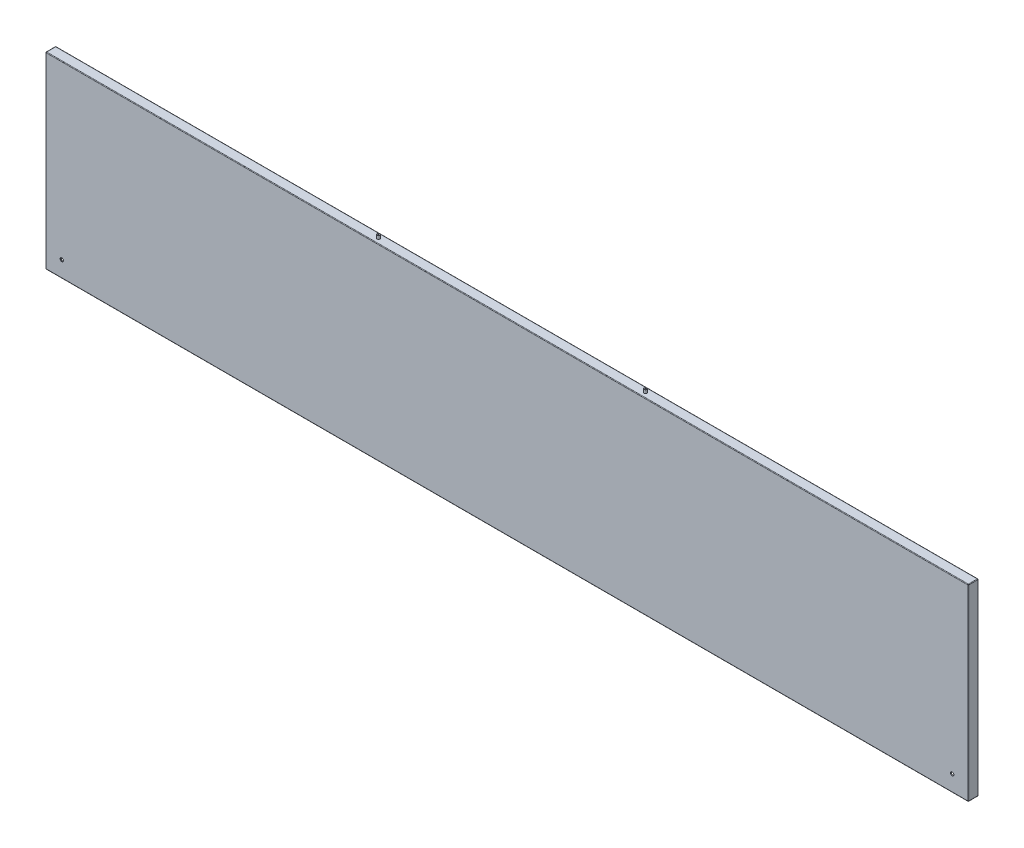
ISO-10303-21;
HEADER;
FILE_DESCRIPTION(('STEP AP214'),'2;1');
FILE_NAME('part.step','',(''),(''),'','','');
FILE_SCHEMA(('AUTOMOTIVE_DESIGN { 1 0 10303 214 1 1 1 1 }'));
ENDSEC;
DATA;
#1=APPLICATION_CONTEXT('core data for automotive mechanical design processes');
#2=APPLICATION_PROTOCOL_DEFINITION('international standard','automotive_design',2000,#1);
#3=PRODUCT_CONTEXT('',#1,'mechanical');
#4=PRODUCT('Part','Part','',(#3));
#5=PRODUCT_RELATED_PRODUCT_CATEGORY('part','',(#4));
#6=PRODUCT_DEFINITION_FORMATION('','',#4);
#7=PRODUCT_DEFINITION_CONTEXT('part definition',#1,'design');
#8=PRODUCT_DEFINITION('design','',#6,#7);
#9=PRODUCT_DEFINITION_SHAPE('','',#8);
#10=(LENGTH_UNIT() NAMED_UNIT(*) SI_UNIT(.MILLI.,.METRE.));
#11=(NAMED_UNIT(*) PLANE_ANGLE_UNIT() SI_UNIT($,.RADIAN.));
#12=(NAMED_UNIT(*) SI_UNIT($,.STERADIAN.) SOLID_ANGLE_UNIT());
#13=UNCERTAINTY_MEASURE_WITH_UNIT(LENGTH_MEASURE(1.E-05),#10,'distance_accuracy_value','');
#14=(GEOMETRIC_REPRESENTATION_CONTEXT(3) GLOBAL_UNCERTAINTY_ASSIGNED_CONTEXT((#13)) GLOBAL_UNIT_ASSIGNED_CONTEXT((#10,
#11,#12)) REPRESENTATION_CONTEXT('',''));
#15=CARTESIAN_POINT('',(0.,0.,0.));
#16=DIRECTION('',(0.,0.,1.));
#17=DIRECTION('',(1.,0.,0.));
#18=AXIS2_PLACEMENT_3D('',#15,#16,#17);
#19=CARTESIAN_POINT('',(829.,169.,1.5));
#20=DIRECTION('',(0.,-1.,0.));
#21=DIRECTION('',(1.,0.,0.));
#22=AXIS2_PLACEMENT_3D('',#19,#20,#21);
#23=PLANE('',#22);
#24=DIRECTION('',(0.,0.,-1.));
#25=VECTOR('',#24,1.);
#26=CARTESIAN_POINT('',(828.,169.,1.5));
#27=LINE('',#26,#25);
#28=CARTESIAN_POINT('',(828.,169.,0.5));
#29=VERTEX_POINT('',#28);
#30=CARTESIAN_POINT('',(828.,169.,-15.5));
#31=VERTEX_POINT('',#30);
#32=EDGE_CURVE('E293',#29,#31,#27,.T.);
#33=ORIENTED_EDGE('',*,*,#32,.T.);
#34=DIRECTION('',(1.,0.,0.));
#35=VECTOR('',#34,1.);
#36=CARTESIAN_POINT('',(829.,169.,-15.5));
#37=LINE('',#36,#35);
#38=CARTESIAN_POINT('',(-828.,169.,-15.5));
#39=VERTEX_POINT('',#38);
#40=EDGE_CURVE('E299',#31,#39,#37,.F.);
#41=ORIENTED_EDGE('',*,*,#40,.T.);
#42=DIRECTION('',(0.,0.,-1.));
#43=VECTOR('',#42,1.);
#44=CARTESIAN_POINT('',(-828.,169.,1.5));
#45=LINE('',#44,#43);
#46=CARTESIAN_POINT('',(-828.,169.,0.5));
#47=VERTEX_POINT('',#46);
#48=EDGE_CURVE('E297',#39,#47,#45,.F.);
#49=ORIENTED_EDGE('',*,*,#48,.T.);
#50=DIRECTION('',(-1.,0.,0.));
#51=VECTOR('',#50,1.);
#52=CARTESIAN_POINT('',(829.,169.,0.5));
#53=LINE('',#52,#51);
#54=EDGE_CURVE('E295',#47,#29,#53,.F.);
#55=ORIENTED_EDGE('',*,*,#54,.T.);
#56=EDGE_LOOP('',(#33,#41,#49,#55));
#57=FACE_BOUND('',#56,.T.);
#58=CARTESIAN_POINT('',(240.,169.,-7.5));
#59=DIRECTION('',(0.,-1.,0.));
#60=DIRECTION('',(1.,0.,0.));
#61=AXIS2_PLACEMENT_3D('',#58,#59,#60);
#62=CIRCLE('',#61,2.50000000000002);
#63=CARTESIAN_POINT('',(242.5,169.,-7.5));
#64=VERTEX_POINT('',#63);
#65=EDGE_CURVE('E251',#64,#64,#62,.F.);
#66=ORIENTED_EDGE('',*,*,#65,.F.);
#67=EDGE_LOOP('',(#66));
#68=FACE_BOUND('',#67,.T.);
#69=CARTESIAN_POINT('',(-240.,169.,-7.5));
#70=DIRECTION('',(0.,-1.,0.));
#71=DIRECTION('',(1.,0.,0.));
#72=AXIS2_PLACEMENT_3D('',#69,#70,#71);
#73=CIRCLE('',#72,2.5);
#74=CARTESIAN_POINT('',(-237.5,169.,-7.5));
#75=VERTEX_POINT('',#74);
#76=EDGE_CURVE('E254',#75,#75,#73,.F.);
#77=ORIENTED_EDGE('',*,*,#76,.F.);
#78=EDGE_LOOP('',(#77));
#79=FACE_BOUND('',#78,.T.);
#80=ADVANCED_FACE('F33',(#57,#68,#79),#23,.F.);
#81=CARTESIAN_POINT('',(-829.,-169.,1.5));
#82=DIRECTION('',(1.,0.,0.));
#83=DIRECTION('',(0.,0.,-1.));
#84=AXIS2_PLACEMENT_3D('',#81,#82,#83);
#85=PLANE('',#84);
#86=DIRECTION('',(0.,-1.,0.));
#87=VECTOR('',#86,1.);
#88=CARTESIAN_POINT('',(-829.,169.,0.5));
#89=LINE('',#88,#87);
#90=CARTESIAN_POINT('',(-829.,-168.,0.5));
#91=VERTEX_POINT('',#90);
#92=CARTESIAN_POINT('',(-829.,168.,0.5));
#93=VERTEX_POINT('',#92);
#94=EDGE_CURVE('E302',#91,#93,#89,.F.);
#95=ORIENTED_EDGE('',*,*,#94,.T.);
#96=DIRECTION('',(0.,0.,-1.));
#97=VECTOR('',#96,1.);
#98=CARTESIAN_POINT('',(-829.,168.,1.5));
#99=LINE('',#98,#97);
#100=CARTESIAN_POINT('',(-829.,168.,-15.5));
#101=VERTEX_POINT('',#100);
#102=EDGE_CURVE('E308',#93,#101,#99,.T.);
#103=ORIENTED_EDGE('',*,*,#102,.T.);
#104=DIRECTION('',(0.,1.,0.));
#105=VECTOR('',#104,1.);
#106=CARTESIAN_POINT('',(-829.,-169.,-15.5));
#107=LINE('',#106,#105);
#108=CARTESIAN_POINT('',(-829.,-168.,-15.5));
#109=VERTEX_POINT('',#108);
#110=EDGE_CURVE('E306',#101,#109,#107,.F.);
#111=ORIENTED_EDGE('',*,*,#110,.T.);
#112=DIRECTION('',(0.,0.,-1.));
#113=VECTOR('',#112,1.);
#114=CARTESIAN_POINT('',(-829.,-168.,1.5));
#115=LINE('',#114,#113);
#116=EDGE_CURVE('E304',#109,#91,#115,.F.);
#117=ORIENTED_EDGE('',*,*,#116,.T.);
#118=EDGE_LOOP('',(#95,#103,#111,#117));
#119=FACE_BOUND('',#118,.T.);
#120=ADVANCED_FACE('F418',(#119),#85,.F.);
#121=CARTESIAN_POINT('',(829.,-169.,1.5));
#122=DIRECTION('',(0.,1.,0.));
#123=DIRECTION('',(-1.,0.,0.));
#124=AXIS2_PLACEMENT_3D('',#121,#122,#123);
#125=PLANE('',#124);
#126=DIRECTION('',(0.,0.,-1.));
#127=VECTOR('',#126,1.);
#128=CARTESIAN_POINT('',(-828.,-169.,1.5));
#129=LINE('',#128,#127);
#130=CARTESIAN_POINT('',(-828.,-169.,0.5));
#131=VERTEX_POINT('',#130);
#132=CARTESIAN_POINT('',(-828.,-169.,-15.5));
#133=VERTEX_POINT('',#132);
#134=EDGE_CURVE('E277',#131,#133,#129,.T.);
#135=ORIENTED_EDGE('',*,*,#134,.T.);
#136=DIRECTION('',(-1.,0.,0.));
#137=VECTOR('',#136,1.);
#138=CARTESIAN_POINT('',(829.,-169.,-15.5));
#139=LINE('',#138,#137);
#140=CARTESIAN_POINT('',(828.,-169.,-15.5));
#141=VERTEX_POINT('',#140);
#142=EDGE_CURVE('E281',#133,#141,#139,.F.);
#143=ORIENTED_EDGE('',*,*,#142,.T.);
#144=DIRECTION('',(0.,0.,-1.));
#145=VECTOR('',#144,1.);
#146=CARTESIAN_POINT('',(828.,-169.,1.5));
#147=LINE('',#146,#145);
#148=CARTESIAN_POINT('',(828.,-169.,0.5));
#149=VERTEX_POINT('',#148);
#150=EDGE_CURVE('E279',#141,#149,#147,.F.);
#151=ORIENTED_EDGE('',*,*,#150,.T.);
#152=DIRECTION('',(1.,0.,0.));
#153=VECTOR('',#152,1.);
#154=CARTESIAN_POINT('',(-829.,-169.,0.5));
#155=LINE('',#154,#153);
#156=EDGE_CURVE('E275',#149,#131,#155,.F.);
#157=ORIENTED_EDGE('',*,*,#156,.T.);
#158=EDGE_LOOP('',(#135,#143,#151,#157));
#159=FACE_BOUND('',#158,.T.);
#160=ADVANCED_FACE('F493',(#159),#125,.F.);
#161=CARTESIAN_POINT('',(829.,-169.,1.5));
#162=DIRECTION('',(-1.,0.,0.));
#163=DIRECTION('',(0.,0.,1.));
#164=AXIS2_PLACEMENT_3D('',#161,#162,#163);
#165=PLANE('',#164);
#166=DIRECTION('',(0.,0.,-1.));
#167=VECTOR('',#166,1.);
#168=CARTESIAN_POINT('',(829.,-168.,1.5));
#169=LINE('',#168,#167);
#170=CARTESIAN_POINT('',(829.,-168.,0.5));
#171=VERTEX_POINT('',#170);
#172=CARTESIAN_POINT('',(829.,-168.,-15.5));
#173=VERTEX_POINT('',#172);
#174=EDGE_CURVE('E288',#171,#173,#169,.T.);
#175=ORIENTED_EDGE('',*,*,#174,.T.);
#176=DIRECTION('',(0.,-1.,0.));
#177=VECTOR('',#176,1.);
#178=CARTESIAN_POINT('',(829.,-169.,-15.5));
#179=LINE('',#178,#177);
#180=CARTESIAN_POINT('',(829.,168.,-15.5));
#181=VERTEX_POINT('',#180);
#182=EDGE_CURVE('E290',#173,#181,#179,.F.);
#183=ORIENTED_EDGE('',*,*,#182,.T.);
#184=DIRECTION('',(0.,0.,-1.));
#185=VECTOR('',#184,1.);
#186=CARTESIAN_POINT('',(829.,168.,1.5));
#187=LINE('',#186,#185);
#188=CARTESIAN_POINT('',(829.,168.,0.5));
#189=VERTEX_POINT('',#188);
#190=EDGE_CURVE('E284',#181,#189,#187,.F.);
#191=ORIENTED_EDGE('',*,*,#190,.T.);
#192=DIRECTION('',(0.,1.,0.));
#193=VECTOR('',#192,1.);
#194=CARTESIAN_POINT('',(829.,-169.,0.5));
#195=LINE('',#194,#193);
#196=EDGE_CURVE('E286',#189,#171,#195,.F.);
#197=ORIENTED_EDGE('',*,*,#196,.T.);
#198=EDGE_LOOP('',(#175,#183,#191,#197));
#199=FACE_BOUND('',#198,.T.);
#200=ADVANCED_FACE('F485',(#199),#165,.F.);
#201=CARTESIAN_POINT('',(0.,0.,1.5));
#202=DIRECTION('',(0.,0.,1.));
#203=DIRECTION('',(1.,0.,0.));
#204=AXIS2_PLACEMENT_3D('',#201,#202,#203);
#205=PLANE('',#204);
#206=DIRECTION('',(-1.,0.,0.));
#207=VECTOR('',#206,1.);
#208=CARTESIAN_POINT('',(-829.,168.,1.5));
#209=LINE('',#208,#207);
#210=CARTESIAN_POINT('',(828.,168.,1.5));
#211=VERTEX_POINT('',#210);
#212=CARTESIAN_POINT('',(-828.,168.,1.5));
#213=VERTEX_POINT('',#212);
#214=EDGE_CURVE('E57',#211,#213,#209,.T.);
#215=ORIENTED_EDGE('',*,*,#214,.T.);
#216=DIRECTION('',(0.,-1.,0.));
#217=VECTOR('',#216,1.);
#218=CARTESIAN_POINT('',(-828.,-169.,1.5));
#219=LINE('',#218,#217);
#220=CARTESIAN_POINT('',(-828.,-168.,1.5));
#221=VERTEX_POINT('',#220);
#222=EDGE_CURVE('E11',#213,#221,#219,.T.);
#223=ORIENTED_EDGE('',*,*,#222,.T.);
#224=DIRECTION('',(1.,0.,0.));
#225=VECTOR('',#224,1.);
#226=CARTESIAN_POINT('',(829.,-168.,1.5));
#227=LINE('',#226,#225);
#228=CARTESIAN_POINT('',(828.,-168.,1.5));
#229=VERTEX_POINT('',#228);
#230=EDGE_CURVE('E42',#221,#229,#227,.T.);
#231=ORIENTED_EDGE('',*,*,#230,.T.);
#232=DIRECTION('',(0.,1.,0.));
#233=VECTOR('',#232,1.);
#234=CARTESIAN_POINT('',(828.,169.,1.5));
#235=LINE('',#234,#233);
#236=EDGE_CURVE('E311',#229,#211,#235,.T.);
#237=ORIENTED_EDGE('',*,*,#236,.T.);
#238=EDGE_LOOP('',(#215,#223,#231,#237));
#239=FACE_BOUND('',#238,.T.);
#240=CARTESIAN_POINT('',(800.,-140.,1.5));
#241=DIRECTION('',(0.,0.,1.));
#242=DIRECTION('',(1.,0.,0.));
#243=AXIS2_PLACEMENT_3D('',#240,#241,#242);
#244=CIRCLE('',#243,3.00000000000005);
#245=CARTESIAN_POINT('',(803.,-140.,1.5));
#246=VERTEX_POINT('',#245);
#247=EDGE_CURVE('E266',#246,#246,#244,.T.);
#248=ORIENTED_EDGE('',*,*,#247,.F.);
#249=EDGE_LOOP('',(#248));
#250=FACE_BOUND('',#249,.T.);
#251=CARTESIAN_POINT('',(-800.,-140.,1.5));
#252=DIRECTION('',(0.,0.,1.));
#253=DIRECTION('',(1.,0.,0.));
#254=AXIS2_PLACEMENT_3D('',#251,#252,#253);
#255=CIRCLE('',#254,3.00000000000005);
#256=CARTESIAN_POINT('',(-797.,-140.,1.5));
#257=VERTEX_POINT('',#256);
#258=EDGE_CURVE('E262',#257,#257,#255,.T.);
#259=ORIENTED_EDGE('',*,*,#258,.F.);
#260=EDGE_LOOP('',(#259));
#261=FACE_BOUND('',#260,.T.);
#262=ADVANCED_FACE('F463',(#239,#250,#261),#205,.T.);
#263=CARTESIAN_POINT('',(0.,0.,-16.5));
#264=DIRECTION('',(0.,0.,1.));
#265=DIRECTION('',(1.,0.,0.));
#266=AXIS2_PLACEMENT_3D('',#263,#264,#265);
#267=PLANE('',#266);
#268=DIRECTION('',(0.,-1.,0.));
#269=VECTOR('',#268,1.);
#270=CARTESIAN_POINT('',(828.,0.,-16.5));
#271=LINE('',#270,#269);
#272=CARTESIAN_POINT('',(828.,168.,-16.5));
#273=VERTEX_POINT('',#272);
#274=CARTESIAN_POINT('',(828.,-168.,-16.5));
#275=VERTEX_POINT('',#274);
#276=EDGE_CURVE('E270',#273,#275,#271,.T.);
#277=ORIENTED_EDGE('',*,*,#276,.T.);
#278=DIRECTION('',(-1.,0.,0.));
#279=VECTOR('',#278,1.);
#280=CARTESIAN_POINT('',(0.,-168.,-16.5));
#281=LINE('',#280,#279);
#282=CARTESIAN_POINT('',(-828.,-168.,-16.5));
#283=VERTEX_POINT('',#282);
#284=EDGE_CURVE('E272',#275,#283,#281,.T.);
#285=ORIENTED_EDGE('',*,*,#284,.T.);
#286=DIRECTION('',(0.,1.,0.));
#287=VECTOR('',#286,1.);
#288=CARTESIAN_POINT('',(-828.,0.,-16.5));
#289=LINE('',#288,#287);
#290=CARTESIAN_POINT('',(-828.,168.,-16.5));
#291=VERTEX_POINT('',#290);
#292=EDGE_CURVE('E257',#283,#291,#289,.T.);
#293=ORIENTED_EDGE('',*,*,#292,.T.);
#294=DIRECTION('',(1.,0.,0.));
#295=VECTOR('',#294,1.);
#296=CARTESIAN_POINT('',(0.,168.,-16.5));
#297=LINE('',#296,#295);
#298=EDGE_CURVE('E268',#291,#273,#297,.T.);
#299=ORIENTED_EDGE('',*,*,#298,.T.);
#300=EDGE_LOOP('',(#277,#285,#293,#299));
#301=FACE_BOUND('',#300,.T.);
#302=DIRECTION('',(0.,1.,0.));
#303=VECTOR('',#302,1.);
#304=CARTESIAN_POINT('',(-819.,-159.,-16.5));
#305=LINE('',#304,#303);
#306=CARTESIAN_POINT('',(-819.,-159.,-16.5));
#307=VERTEX_POINT('',#306);
#308=CARTESIAN_POINT('',(-819.,159.,-16.5));
#309=VERTEX_POINT('',#308);
#310=EDGE_CURVE('E175',#307,#309,#305,.T.);
#311=ORIENTED_EDGE('',*,*,#310,.F.);
#312=DIRECTION('',(-1.,0.,0.));
#313=VECTOR('',#312,1.);
#314=CARTESIAN_POINT('',(819.,-159.,-16.5));
#315=LINE('',#314,#313);
#316=CARTESIAN_POINT('',(819.,-159.,-16.5));
#317=VERTEX_POINT('',#316);
#318=EDGE_CURVE('E201',#317,#307,#315,.T.);
#319=ORIENTED_EDGE('',*,*,#318,.F.);
#320=DIRECTION('',(0.,-1.,0.));
#321=VECTOR('',#320,1.);
#322=CARTESIAN_POINT('',(819.,-159.,-16.5));
#323=LINE('',#322,#321);
#324=CARTESIAN_POINT('',(819.,159.,-16.5));
#325=VERTEX_POINT('',#324);
#326=EDGE_CURVE('E199',#325,#317,#323,.T.);
#327=ORIENTED_EDGE('',*,*,#326,.F.);
#328=DIRECTION('',(1.,0.,0.));
#329=VECTOR('',#328,1.);
#330=CARTESIAN_POINT('',(819.,159.,-16.5));
#331=LINE('',#330,#329);
#332=EDGE_CURVE('E185',#309,#325,#331,.T.);
#333=ORIENTED_EDGE('',*,*,#332,.F.);
#334=EDGE_LOOP('',(#311,#319,#327,#333));
#335=FACE_BOUND('',#334,.T.);
#336=ADVANCED_FACE('F197',(#301,#335),#267,.F.);
#337=CARTESIAN_POINT('',(0.,0.,-15.));
#338=DIRECTION('',(0.,0.,1.));
#339=DIRECTION('',(1.,0.,0.));
#340=AXIS2_PLACEMENT_3D('',#337,#338,#339);
#341=PLANE('',#340);
#342=DIRECTION('',(1.,0.,0.));
#343=VECTOR('',#342,1.);
#344=CARTESIAN_POINT('',(827.500000000001,167.5,-15.));
#345=LINE('',#344,#343);
#346=CARTESIAN_POINT('',(-827.5,167.5,-15.));
#347=VERTEX_POINT('',#346);
#348=CARTESIAN_POINT('',(827.500000000001,167.5,-15.));
#349=VERTEX_POINT('',#348);
#350=EDGE_CURVE('E222',#347,#349,#345,.T.);
#351=ORIENTED_EDGE('',*,*,#350,.F.);
#352=DIRECTION('',(0.,1.,0.));
#353=VECTOR('',#352,1.);
#354=CARTESIAN_POINT('',(-827.5,-167.5,-15.));
#355=LINE('',#354,#353);
#356=CARTESIAN_POINT('',(-827.5,-167.5,-15.));
#357=VERTEX_POINT('',#356);
#358=EDGE_CURVE('E219',#357,#347,#355,.T.);
#359=ORIENTED_EDGE('',*,*,#358,.F.);
#360=DIRECTION('',(-1.,0.,0.));
#361=VECTOR('',#360,1.);
#362=CARTESIAN_POINT('',(827.500000000001,-167.5,-15.));
#363=LINE('',#362,#361);
#364=CARTESIAN_POINT('',(827.500000000001,-167.5,-15.));
#365=VERTEX_POINT('',#364);
#366=EDGE_CURVE('E229',#365,#357,#363,.T.);
#367=ORIENTED_EDGE('',*,*,#366,.F.);
#368=DIRECTION('',(0.,-1.,0.));
#369=VECTOR('',#368,1.);
#370=CARTESIAN_POINT('',(827.500000000001,-167.5,-15.));
#371=LINE('',#370,#369);
#372=EDGE_CURVE('E226',#349,#365,#371,.T.);
#373=ORIENTED_EDGE('',*,*,#372,.F.);
#374=EDGE_LOOP('',(#351,#359,#367,#373));
#375=FACE_BOUND('',#374,.T.);
#376=DIRECTION('',(-1.,0.,0.));
#377=VECTOR('',#376,1.);
#378=CARTESIAN_POINT('',(819.,-159.,-15.));
#379=LINE('',#378,#377);
#380=CARTESIAN_POINT('',(819.,-159.,-15.));
#381=VERTEX_POINT('',#380);
#382=CARTESIAN_POINT('',(-819.,-159.,-15.));
#383=VERTEX_POINT('',#382);
#384=EDGE_CURVE('E186',#381,#383,#379,.T.);
#385=ORIENTED_EDGE('',*,*,#384,.T.);
#386=DIRECTION('',(0.,1.,0.));
#387=VECTOR('',#386,1.);
#388=CARTESIAN_POINT('',(-819.,-159.,-15.));
#389=LINE('',#388,#387);
#390=CARTESIAN_POINT('',(-819.,159.,-15.));
#391=VERTEX_POINT('',#390);
#392=EDGE_CURVE('E206',#383,#391,#389,.T.);
#393=ORIENTED_EDGE('',*,*,#392,.T.);
#394=DIRECTION('',(1.,0.,0.));
#395=VECTOR('',#394,1.);
#396=CARTESIAN_POINT('',(819.,159.,-15.));
#397=LINE('',#396,#395);
#398=CARTESIAN_POINT('',(819.,159.,-15.));
#399=VERTEX_POINT('',#398);
#400=EDGE_CURVE('E192',#391,#399,#397,.T.);
#401=ORIENTED_EDGE('',*,*,#400,.T.);
#402=DIRECTION('',(0.,-1.,0.));
#403=VECTOR('',#402,1.);
#404=CARTESIAN_POINT('',(819.,-159.,-15.));
#405=LINE('',#404,#403);
#406=EDGE_CURVE('E210',#399,#381,#405,.T.);
#407=ORIENTED_EDGE('',*,*,#406,.T.);
#408=EDGE_LOOP('',(#385,#393,#401,#407));
#409=FACE_BOUND('',#408,.T.);
#410=ADVANCED_FACE('F460',(#375,#409),#341,.T.);
#411=CARTESIAN_POINT('',(-819.,-159.,-16.5));
#412=DIRECTION('',(1.,0.,0.));
#413=DIRECTION('',(0.,0.,-1.));
#414=AXIS2_PLACEMENT_3D('',#411,#412,#413);
#415=PLANE('',#414);
#416=ORIENTED_EDGE('',*,*,#392,.F.);
#417=DIRECTION('',(0.,0.,1.));
#418=VECTOR('',#417,1.);
#419=CARTESIAN_POINT('',(-819.,-159.,-16.5));
#420=LINE('',#419,#418);
#421=EDGE_CURVE('E181',#307,#383,#420,.T.);
#422=ORIENTED_EDGE('',*,*,#421,.F.);
#423=ORIENTED_EDGE('',*,*,#310,.T.);
#424=DIRECTION('',(0.,0.,1.));
#425=VECTOR('',#424,1.);
#426=CARTESIAN_POINT('',(-819.,159.,-16.5));
#427=LINE('',#426,#425);
#428=EDGE_CURVE('E178',#309,#391,#427,.T.);
#429=ORIENTED_EDGE('',*,*,#428,.T.);
#430=EDGE_LOOP('',(#416,#422,#423,#429));
#431=FACE_BOUND('',#430,.T.);
#432=ADVANCED_FACE('F177',(#431),#415,.T.);
#433=CARTESIAN_POINT('',(819.,159.,-16.5));
#434=DIRECTION('',(0.,-1.,0.));
#435=DIRECTION('',(0.,0.,-1.));
#436=AXIS2_PLACEMENT_3D('',#433,#434,#435);
#437=PLANE('',#436);
#438=ORIENTED_EDGE('',*,*,#400,.F.);
#439=ORIENTED_EDGE('',*,*,#428,.F.);
#440=ORIENTED_EDGE('',*,*,#332,.T.);
#441=DIRECTION('',(0.,0.,1.));
#442=VECTOR('',#441,1.);
#443=CARTESIAN_POINT('',(819.,159.,-16.5));
#444=LINE('',#443,#442);
#445=EDGE_CURVE('E194',#325,#399,#444,.T.);
#446=ORIENTED_EDGE('',*,*,#445,.T.);
#447=EDGE_LOOP('',(#438,#439,#440,#446));
#448=FACE_BOUND('',#447,.T.);
#449=ADVANCED_FACE('F189',(#448),#437,.T.);
#450=CARTESIAN_POINT('',(819.,-159.,-16.5));
#451=DIRECTION('',(-1.,0.,0.));
#452=DIRECTION('',(0.,0.,1.));
#453=AXIS2_PLACEMENT_3D('',#450,#451,#452);
#454=PLANE('',#453);
#455=ORIENTED_EDGE('',*,*,#406,.F.);
#456=ORIENTED_EDGE('',*,*,#445,.F.);
#457=ORIENTED_EDGE('',*,*,#326,.T.);
#458=DIRECTION('',(0.,0.,1.));
#459=VECTOR('',#458,1.);
#460=CARTESIAN_POINT('',(819.,-159.,-16.5));
#461=LINE('',#460,#459);
#462=EDGE_CURVE('E216',#317,#381,#461,.T.);
#463=ORIENTED_EDGE('',*,*,#462,.T.);
#464=EDGE_LOOP('',(#455,#456,#457,#463));
#465=FACE_BOUND('',#464,.T.);
#466=ADVANCED_FACE('F451',(#465),#454,.T.);
#467=CARTESIAN_POINT('',(819.,-159.,-16.5));
#468=DIRECTION('',(0.,1.,0.));
#469=DIRECTION('',(0.,0.,1.));
#470=AXIS2_PLACEMENT_3D('',#467,#468,#469);
#471=PLANE('',#470);
#472=ORIENTED_EDGE('',*,*,#384,.F.);
#473=ORIENTED_EDGE('',*,*,#462,.F.);
#474=ORIENTED_EDGE('',*,*,#318,.T.);
#475=ORIENTED_EDGE('',*,*,#421,.T.);
#476=EDGE_LOOP('',(#472,#473,#474,#475));
#477=FACE_BOUND('',#476,.T.);
#478=ADVANCED_FACE('F447',(#477),#471,.T.);
#479=CARTESIAN_POINT('',(0.,0.,0.));
#480=DIRECTION('',(0.,0.,1.));
#481=DIRECTION('',(1.,0.,0.));
#482=AXIS2_PLACEMENT_3D('',#479,#480,#481);
#483=PLANE('',#482);
#484=CARTESIAN_POINT('',(800.,-140.,0.));
#485=DIRECTION('',(0.,0.,1.));
#486=DIRECTION('',(1.,0.,0.));
#487=AXIS2_PLACEMENT_3D('',#484,#485,#486);
#488=CIRCLE('',#487,3.00000000000005);
#489=CARTESIAN_POINT('',(803.,-140.,0.));
#490=VERTEX_POINT('',#489);
#491=EDGE_CURVE('E263',#490,#490,#488,.T.);
#492=ORIENTED_EDGE('',*,*,#491,.T.);
#493=EDGE_LOOP('',(#492));
#494=FACE_BOUND('',#493,.T.);
#495=CARTESIAN_POINT('',(-800.,-140.,0.));
#496=DIRECTION('',(0.,0.,1.));
#497=DIRECTION('',(1.,0.,0.));
#498=AXIS2_PLACEMENT_3D('',#495,#496,#497);
#499=CIRCLE('',#498,3.00000000000005);
#500=CARTESIAN_POINT('',(-797.,-140.,0.));
#501=VERTEX_POINT('',#500);
#502=EDGE_CURVE('E258',#501,#501,#499,.T.);
#503=ORIENTED_EDGE('',*,*,#502,.T.);
#504=EDGE_LOOP('',(#503));
#505=FACE_BOUND('',#504,.T.);
#506=DIRECTION('',(-1.,0.,0.));
#507=VECTOR('',#506,1.);
#508=CARTESIAN_POINT('',(827.500000000001,-167.5,0.));
#509=LINE('',#508,#507);
#510=CARTESIAN_POINT('',(827.500000000001,-167.5,0.));
#511=VERTEX_POINT('',#510);
#512=CARTESIAN_POINT('',(-827.5,-167.5,0.));
#513=VERTEX_POINT('',#512);
#514=EDGE_CURVE('E223',#511,#513,#509,.T.);
#515=ORIENTED_EDGE('',*,*,#514,.T.);
#516=DIRECTION('',(0.,1.,0.));
#517=VECTOR('',#516,1.);
#518=CARTESIAN_POINT('',(-827.5,-167.5,0.));
#519=LINE('',#518,#517);
#520=CARTESIAN_POINT('',(-827.5,167.5,0.));
#521=VERTEX_POINT('',#520);
#522=EDGE_CURVE('E193',#513,#521,#519,.T.);
#523=ORIENTED_EDGE('',*,*,#522,.T.);
#524=DIRECTION('',(1.,0.,0.));
#525=VECTOR('',#524,1.);
#526=CARTESIAN_POINT('',(827.500000000001,167.5,0.));
#527=LINE('',#526,#525);
#528=CARTESIAN_POINT('',(827.500000000001,167.5,0.));
#529=VERTEX_POINT('',#528);
#530=EDGE_CURVE('E235',#521,#529,#527,.T.);
#531=ORIENTED_EDGE('',*,*,#530,.T.);
#532=DIRECTION('',(0.,-1.,0.));
#533=VECTOR('',#532,1.);
#534=CARTESIAN_POINT('',(827.500000000001,-167.5,0.));
#535=LINE('',#534,#533);
#536=EDGE_CURVE('E238',#529,#511,#535,.T.);
#537=ORIENTED_EDGE('',*,*,#536,.T.);
#538=EDGE_LOOP('',(#515,#523,#531,#537));
#539=FACE_BOUND('',#538,.T.);
#540=ADVANCED_FACE('F450',(#494,#505,#539),#483,.F.);
#541=CARTESIAN_POINT('',(827.500000000001,-167.5,-15.));
#542=DIRECTION('',(0.,1.,0.));
#543=DIRECTION('',(0.,0.,1.));
#544=AXIS2_PLACEMENT_3D('',#541,#542,#543);
#545=PLANE('',#544);
#546=ORIENTED_EDGE('',*,*,#514,.F.);
#547=DIRECTION('',(0.,0.,1.));
#548=VECTOR('',#547,1.);
#549=CARTESIAN_POINT('',(827.500000000001,-167.5,-15.));
#550=LINE('',#549,#548);
#551=EDGE_CURVE('E244',#365,#511,#550,.T.);
#552=ORIENTED_EDGE('',*,*,#551,.F.);
#553=ORIENTED_EDGE('',*,*,#366,.T.);
#554=DIRECTION('',(0.,0.,1.));
#555=VECTOR('',#554,1.);
#556=CARTESIAN_POINT('',(-827.5,-167.5,-15.));
#557=LINE('',#556,#555);
#558=EDGE_CURVE('E232',#357,#513,#557,.T.);
#559=ORIENTED_EDGE('',*,*,#558,.T.);
#560=EDGE_LOOP('',(#546,#552,#553,#559));
#561=FACE_BOUND('',#560,.T.);
#562=ADVANCED_FACE('F468',(#561),#545,.T.);
#563=CARTESIAN_POINT('',(827.500000000001,-167.5,-15.));
#564=DIRECTION('',(-1.,0.,0.));
#565=DIRECTION('',(0.,0.,1.));
#566=AXIS2_PLACEMENT_3D('',#563,#564,#565);
#567=PLANE('',#566);
#568=ORIENTED_EDGE('',*,*,#536,.F.);
#569=DIRECTION('',(0.,0.,1.));
#570=VECTOR('',#569,1.);
#571=CARTESIAN_POINT('',(827.500000000001,167.5,-15.));
#572=LINE('',#571,#570);
#573=EDGE_CURVE('E246',#349,#529,#572,.T.);
#574=ORIENTED_EDGE('',*,*,#573,.F.);
#575=ORIENTED_EDGE('',*,*,#372,.T.);
#576=ORIENTED_EDGE('',*,*,#551,.T.);
#577=EDGE_LOOP('',(#568,#574,#575,#576));
#578=FACE_BOUND('',#577,.T.);
#579=ADVANCED_FACE('F471',(#578),#567,.T.);
#580=CARTESIAN_POINT('',(827.500000000001,167.5,-15.));
#581=DIRECTION('',(0.,-1.,0.));
#582=DIRECTION('',(0.,0.,-1.));
#583=AXIS2_PLACEMENT_3D('',#580,#581,#582);
#584=PLANE('',#583);
#585=ORIENTED_EDGE('',*,*,#530,.F.);
#586=DIRECTION('',(0.,0.,1.));
#587=VECTOR('',#586,1.);
#588=CARTESIAN_POINT('',(-827.5,167.5,-15.));
#589=LINE('',#588,#587);
#590=EDGE_CURVE('E248',#347,#521,#589,.T.);
#591=ORIENTED_EDGE('',*,*,#590,.F.);
#592=ORIENTED_EDGE('',*,*,#350,.T.);
#593=ORIENTED_EDGE('',*,*,#573,.T.);
#594=EDGE_LOOP('',(#585,#591,#592,#593));
#595=FACE_BOUND('',#594,.T.);
#596=ADVANCED_FACE('F475',(#595),#584,.T.);
#597=CARTESIAN_POINT('',(-827.5,-167.5,-15.));
#598=DIRECTION('',(1.,0.,0.));
#599=DIRECTION('',(0.,0.,-1.));
#600=AXIS2_PLACEMENT_3D('',#597,#598,#599);
#601=PLANE('',#600);
#602=ORIENTED_EDGE('',*,*,#522,.F.);
#603=ORIENTED_EDGE('',*,*,#558,.F.);
#604=ORIENTED_EDGE('',*,*,#358,.T.);
#605=ORIENTED_EDGE('',*,*,#590,.T.);
#606=EDGE_LOOP('',(#602,#603,#604,#605));
#607=FACE_BOUND('',#606,.T.);
#608=ADVANCED_FACE('F445',(#607),#601,.T.);
#609=CARTESIAN_POINT('',(240.,175.,-7.5));
#610=DIRECTION('',(0.,1.,0.));
#611=DIRECTION('',(-1.,0.,0.));
#612=AXIS2_PLACEMENT_3D('',#609,#610,#611);
#613=PLANE('',#612);
#614=CARTESIAN_POINT('',(240.,175.,-7.5));
#615=DIRECTION('',(0.,1.,0.));
#616=DIRECTION('',(-1.,0.,0.));
#617=AXIS2_PLACEMENT_3D('',#614,#615,#616);
#618=CIRCLE('',#617,2.50000000000002);
#619=CARTESIAN_POINT('',(237.5,175.,-7.5));
#620=VERTEX_POINT('',#619);
#621=EDGE_CURVE('E208',#620,#620,#618,.T.);
#622=ORIENTED_EDGE('',*,*,#621,.T.);
#623=EDGE_LOOP('',(#622));
#624=FACE_BOUND('',#623,.T.);
#625=CARTESIAN_POINT('',(240.,175.,-7.5));
#626=DIRECTION('',(0.,1.,0.));
#627=DIRECTION('',(-1.,0.,0.));
#628=AXIS2_PLACEMENT_3D('',#625,#626,#627);
#629=CIRCLE('',#628,0.999999999999998);
#630=CARTESIAN_POINT('',(239.,175.,-7.5));
#631=VERTEX_POINT('',#630);
#632=EDGE_CURVE('E399',#631,#631,#629,.T.);
#633=ORIENTED_EDGE('',*,*,#632,.F.);
#634=EDGE_LOOP('',(#633));
#635=FACE_BOUND('',#634,.T.);
#636=ADVANCED_FACE('F406',(#624,#635),#613,.T.);
#637=CARTESIAN_POINT('',(240.,175.,-7.5));
#638=DIRECTION('',(0.,-1.,0.));
#639=DIRECTION('',(1.,0.,0.));
#640=AXIS2_PLACEMENT_3D('',#637,#638,#639);
#641=CYLINDRICAL_SURFACE('',#640,2.50000000000002);
#642=ORIENTED_EDGE('',*,*,#621,.F.);
#643=EDGE_LOOP('',(#642));
#644=FACE_BOUND('',#643,.T.);
#645=ORIENTED_EDGE('',*,*,#65,.T.);
#646=EDGE_LOOP('',(#645));
#647=FACE_BOUND('',#646,.T.);
#648=ADVANCED_FACE('F409',(#644,#647),#641,.T.);
#649=CARTESIAN_POINT('',(240.,175.,-7.5));
#650=DIRECTION('',(0.,-1.,0.));
#651=DIRECTION('',(1.,0.,0.));
#652=AXIS2_PLACEMENT_3D('',#649,#650,#651);
#653=CYLINDRICAL_SURFACE('',#652,0.999999999999998);
#654=ORIENTED_EDGE('',*,*,#632,.T.);
#655=EDGE_LOOP('',(#654));
#656=FACE_BOUND('',#655,.T.);
#657=CARTESIAN_POINT('',(240.,169.,-7.5));
#658=DIRECTION('',(0.,1.,0.));
#659=DIRECTION('',(-1.,0.,0.));
#660=AXIS2_PLACEMENT_3D('',#657,#658,#659);
#661=CIRCLE('',#660,0.999999999999998);
#662=CARTESIAN_POINT('',(239.,169.,-7.5));
#663=VERTEX_POINT('',#662);
#664=EDGE_CURVE('E398',#663,#663,#661,.T.);
#665=ORIENTED_EDGE('',*,*,#664,.F.);
#666=EDGE_LOOP('',(#665));
#667=FACE_BOUND('',#666,.T.);
#668=ADVANCED_FACE('F412',(#656,#667),#653,.F.);
#669=ORIENTED_EDGE('',*,*,#664,.T.);
#670=EDGE_LOOP('',(#669));
#671=FACE_BOUND('',#670,.T.);
#672=ADVANCED_FACE('F422',(#671),#23,.F.);
#673=CARTESIAN_POINT('',(-240.,175.,-7.5));
#674=DIRECTION('',(0.,1.,0.));
#675=DIRECTION('',(-1.,0.,0.));
#676=AXIS2_PLACEMENT_3D('',#673,#674,#675);
#677=PLANE('',#676);
#678=CARTESIAN_POINT('',(-240.,175.,-7.5));
#679=DIRECTION('',(0.,1.,0.));
#680=DIRECTION('',(-1.,0.,0.));
#681=AXIS2_PLACEMENT_3D('',#678,#679,#680);
#682=CIRCLE('',#681,2.5);
#683=CARTESIAN_POINT('',(-242.5,175.,-7.5));
#684=VERTEX_POINT('',#683);
#685=EDGE_CURVE('E393',#684,#684,#682,.T.);
#686=ORIENTED_EDGE('',*,*,#685,.T.);
#687=EDGE_LOOP('',(#686));
#688=FACE_BOUND('',#687,.T.);
#689=CARTESIAN_POINT('',(-240.,175.,-7.5));
#690=DIRECTION('',(0.,1.,0.));
#691=DIRECTION('',(-1.,0.,0.));
#692=AXIS2_PLACEMENT_3D('',#689,#690,#691);
#693=CIRCLE('',#692,0.999999999999998);
#694=CARTESIAN_POINT('',(-241.,175.,-7.5));
#695=VERTEX_POINT('',#694);
#696=EDGE_CURVE('E390',#695,#695,#693,.T.);
#697=ORIENTED_EDGE('',*,*,#696,.F.);
#698=EDGE_LOOP('',(#697));
#699=FACE_BOUND('',#698,.T.);
#700=ADVANCED_FACE('F428',(#688,#699),#677,.T.);
#701=CARTESIAN_POINT('',(-240.,175.,-7.5));
#702=DIRECTION('',(0.,-1.,0.));
#703=DIRECTION('',(1.,0.,0.));
#704=AXIS2_PLACEMENT_3D('',#701,#702,#703);
#705=CYLINDRICAL_SURFACE('',#704,2.5);
#706=ORIENTED_EDGE('',*,*,#685,.F.);
#707=EDGE_LOOP('',(#706));
#708=FACE_BOUND('',#707,.T.);
#709=ORIENTED_EDGE('',*,*,#76,.T.);
#710=EDGE_LOOP('',(#709));
#711=FACE_BOUND('',#710,.T.);
#712=ADVANCED_FACE('F425',(#708,#711),#705,.T.);
#713=CARTESIAN_POINT('',(-240.,175.,-7.5));
#714=DIRECTION('',(0.,-1.,0.));
#715=DIRECTION('',(1.,0.,0.));
#716=AXIS2_PLACEMENT_3D('',#713,#714,#715);
#717=CYLINDRICAL_SURFACE('',#716,0.999999999999998);
#718=ORIENTED_EDGE('',*,*,#696,.T.);
#719=EDGE_LOOP('',(#718));
#720=FACE_BOUND('',#719,.T.);
#721=CARTESIAN_POINT('',(-240.,169.,-7.5));
#722=DIRECTION('',(0.,1.,0.));
#723=DIRECTION('',(-1.,0.,0.));
#724=AXIS2_PLACEMENT_3D('',#721,#722,#723);
#725=CIRCLE('',#724,0.999999999999998);
#726=CARTESIAN_POINT('',(-241.,169.,-7.5));
#727=VERTEX_POINT('',#726);
#728=EDGE_CURVE('E261',#727,#727,#725,.T.);
#729=ORIENTED_EDGE('',*,*,#728,.F.);
#730=EDGE_LOOP('',(#729));
#731=FACE_BOUND('',#730,.T.);
#732=ADVANCED_FACE('F427',(#720,#731),#717,.F.);
#733=ORIENTED_EDGE('',*,*,#728,.T.);
#734=EDGE_LOOP('',(#733));
#735=FACE_BOUND('',#734,.T.);
#736=ADVANCED_FACE('F421',(#735),#23,.F.);
#737=CARTESIAN_POINT('',(-800.,-140.,-16.5));
#738=DIRECTION('',(0.,0.,1.));
#739=DIRECTION('',(1.,0.,0.));
#740=AXIS2_PLACEMENT_3D('',#737,#738,#739);
#741=CYLINDRICAL_SURFACE('',#740,3.00000000000005);
#742=ORIENTED_EDGE('',*,*,#258,.T.);
#743=EDGE_LOOP('',(#742));
#744=FACE_BOUND('',#743,.T.);
#745=ORIENTED_EDGE('',*,*,#502,.F.);
#746=EDGE_LOOP('',(#745));
#747=FACE_BOUND('',#746,.T.);
#748=ADVANCED_FACE('F618',(#744,#747),#741,.F.);
#749=CARTESIAN_POINT('',(800.,-140.,-16.5));
#750=DIRECTION('',(0.,0.,1.));
#751=DIRECTION('',(1.,0.,0.));
#752=AXIS2_PLACEMENT_3D('',#749,#750,#751);
#753=CYLINDRICAL_SURFACE('',#752,3.00000000000005);
#754=ORIENTED_EDGE('',*,*,#247,.T.);
#755=EDGE_LOOP('',(#754));
#756=FACE_BOUND('',#755,.T.);
#757=ORIENTED_EDGE('',*,*,#491,.F.);
#758=EDGE_LOOP('',(#757));
#759=FACE_BOUND('',#758,.T.);
#760=ADVANCED_FACE('F575',(#756,#759),#753,.F.);
#761=CARTESIAN_POINT('',(0.,168.,0.5));
#762=DIRECTION('',(1.,0.,0.));
#763=DIRECTION('',(0.,1.,0.));
#764=AXIS2_PLACEMENT_3D('',#761,#762,#763);
#765=CYLINDRICAL_SURFACE('',#764,1.);
#766=CARTESIAN_POINT('',(828.,168.,0.5));
#767=DIRECTION('',(1.,0.,0.));
#768=DIRECTION('',(0.,0.,-1.));
#769=AXIS2_PLACEMENT_3D('',#766,#767,#768);
#770=CIRCLE('',#769,1.);
#771=EDGE_CURVE('E37',#29,#211,#770,.T.);
#772=ORIENTED_EDGE('',*,*,#771,.F.);
#773=ORIENTED_EDGE('',*,*,#54,.F.);
#774=CARTESIAN_POINT('',(-828.,168.,0.5));
#775=DIRECTION('',(-1.,0.,0.));
#776=DIRECTION('',(0.,0.,1.));
#777=AXIS2_PLACEMENT_3D('',#774,#775,#776);
#778=CIRCLE('',#777,1.);
#779=EDGE_CURVE('E373',#213,#47,#778,.T.);
#780=ORIENTED_EDGE('',*,*,#779,.F.);
#781=ORIENTED_EDGE('',*,*,#214,.F.);
#782=EDGE_LOOP('',(#772,#773,#780,#781));
#783=FACE_BOUND('',#782,.T.);
#784=ADVANCED_FACE('F35',(#783),#765,.T.);
#785=CARTESIAN_POINT('',(828.,168.,0.5));
#786=DIRECTION('',(0.,0.,1.));
#787=DIRECTION('',(1.,0.,0.));
#788=AXIS2_PLACEMENT_3D('',#785,#786,#787);
#789=SPHERICAL_SURFACE('',#788,1.);
#790=CARTESIAN_POINT('',(828.,168.,0.5));
#791=DIRECTION('',(0.,0.,1.));
#792=DIRECTION('',(1.,0.,0.));
#793=AXIS2_PLACEMENT_3D('',#790,#791,#792);
#794=CIRCLE('',#793,1.);
#795=EDGE_CURVE('E368',#29,#189,#794,.F.);
#796=ORIENTED_EDGE('',*,*,#795,.F.);
#797=ORIENTED_EDGE('',*,*,#771,.T.);
#798=CARTESIAN_POINT('',(828.,168.,0.5));
#799=DIRECTION('',(0.,1.,0.));
#800=DIRECTION('',(0.,0.,1.));
#801=AXIS2_PLACEMENT_3D('',#798,#799,#800);
#802=CIRCLE('',#801,1.);
#803=EDGE_CURVE('E371',#189,#211,#802,.F.);
#804=ORIENTED_EDGE('',*,*,#803,.F.);
#805=EDGE_LOOP('',(#796,#797,#804));
#806=FACE_BOUND('',#805,.T.);
#807=ADVANCED_FACE('F570',(#806),#789,.T.);
#808=CARTESIAN_POINT('',(-828.,168.,0.5));
#809=DIRECTION('',(0.,0.,1.));
#810=DIRECTION('',(1.,0.,0.));
#811=AXIS2_PLACEMENT_3D('',#808,#809,#810);
#812=SPHERICAL_SURFACE('',#811,1.);
#813=CARTESIAN_POINT('',(-828.,168.,0.5));
#814=DIRECTION('',(0.,1.,0.));
#815=DIRECTION('',(0.,0.,1.));
#816=AXIS2_PLACEMENT_3D('',#813,#814,#815);
#817=CIRCLE('',#816,1.);
#818=EDGE_CURVE('E362',#213,#93,#817,.F.);
#819=ORIENTED_EDGE('',*,*,#818,.F.);
#820=ORIENTED_EDGE('',*,*,#779,.T.);
#821=CARTESIAN_POINT('',(-828.,168.,0.5));
#822=DIRECTION('',(0.,0.,1.));
#823=DIRECTION('',(1.,0.,0.));
#824=AXIS2_PLACEMENT_3D('',#821,#822,#823);
#825=CIRCLE('',#824,1.);
#826=EDGE_CURVE('E365',#93,#47,#825,.F.);
#827=ORIENTED_EDGE('',*,*,#826,.F.);
#828=EDGE_LOOP('',(#819,#820,#827));
#829=FACE_BOUND('',#828,.T.);
#830=ADVANCED_FACE('F567',(#829),#812,.T.);
#831=CARTESIAN_POINT('',(828.,0.,0.5));
#832=DIRECTION('',(0.,-1.,0.));
#833=DIRECTION('',(0.,0.,-1.));
#834=AXIS2_PLACEMENT_3D('',#831,#832,#833);
#835=CYLINDRICAL_SURFACE('',#834,1.);
#836=ORIENTED_EDGE('',*,*,#803,.T.);
#837=ORIENTED_EDGE('',*,*,#236,.F.);
#838=CARTESIAN_POINT('',(828.,-168.,0.5));
#839=DIRECTION('',(0.,-1.,0.));
#840=DIRECTION('',(0.,0.,-1.));
#841=AXIS2_PLACEMENT_3D('',#838,#839,#840);
#842=CIRCLE('',#841,1.);
#843=EDGE_CURVE('E356',#171,#229,#842,.T.);
#844=ORIENTED_EDGE('',*,*,#843,.F.);
#845=ORIENTED_EDGE('',*,*,#196,.F.);
#846=EDGE_LOOP('',(#836,#837,#844,#845));
#847=FACE_BOUND('',#846,.T.);
#848=ADVANCED_FACE('F563',(#847),#835,.T.);
#849=CARTESIAN_POINT('',(828.,168.,1.5));
#850=DIRECTION('',(0.,0.,-1.));
#851=DIRECTION('',(-1.,0.,0.));
#852=AXIS2_PLACEMENT_3D('',#849,#850,#851);
#853=CYLINDRICAL_SURFACE('',#852,1.);
#854=ORIENTED_EDGE('',*,*,#795,.T.);
#855=ORIENTED_EDGE('',*,*,#190,.F.);
#856=CARTESIAN_POINT('',(828.,168.,-15.5));
#857=DIRECTION('',(0.,0.,-1.));
#858=DIRECTION('',(-1.,0.,0.));
#859=AXIS2_PLACEMENT_3D('',#856,#857,#858);
#860=CIRCLE('',#859,1.);
#861=EDGE_CURVE('E353',#31,#181,#860,.T.);
#862=ORIENTED_EDGE('',*,*,#861,.F.);
#863=ORIENTED_EDGE('',*,*,#32,.F.);
#864=EDGE_LOOP('',(#854,#855,#862,#863));
#865=FACE_BOUND('',#864,.T.);
#866=ADVANCED_FACE('F559',(#865),#853,.T.);
#867=CARTESIAN_POINT('',(0.,168.,-15.5));
#868=DIRECTION('',(1.,0.,0.));
#869=DIRECTION('',(0.,1.,0.));
#870=AXIS2_PLACEMENT_3D('',#867,#868,#869);
#871=CYLINDRICAL_SURFACE('',#870,1.);
#872=CARTESIAN_POINT('',(-828.,168.,-15.5));
#873=DIRECTION('',(-1.,0.,0.));
#874=DIRECTION('',(0.,0.,1.));
#875=AXIS2_PLACEMENT_3D('',#872,#873,#874);
#876=CIRCLE('',#875,1.);
#877=EDGE_CURVE('E347',#39,#291,#876,.T.);
#878=ORIENTED_EDGE('',*,*,#877,.F.);
#879=ORIENTED_EDGE('',*,*,#40,.F.);
#880=CARTESIAN_POINT('',(828.,168.,-15.5));
#881=DIRECTION('',(1.,0.,0.));
#882=DIRECTION('',(0.,0.,-1.));
#883=AXIS2_PLACEMENT_3D('',#880,#881,#882);
#884=CIRCLE('',#883,1.);
#885=EDGE_CURVE('E350',#273,#31,#884,.T.);
#886=ORIENTED_EDGE('',*,*,#885,.F.);
#887=ORIENTED_EDGE('',*,*,#298,.F.);
#888=EDGE_LOOP('',(#878,#879,#886,#887));
#889=FACE_BOUND('',#888,.T.);
#890=ADVANCED_FACE('F555',(#889),#871,.T.);
#891=CARTESIAN_POINT('',(-828.,168.,1.5));
#892=DIRECTION('',(0.,0.,-1.));
#893=DIRECTION('',(-1.,0.,0.));
#894=AXIS2_PLACEMENT_3D('',#891,#892,#893);
#895=CYLINDRICAL_SURFACE('',#894,1.);
#896=ORIENTED_EDGE('',*,*,#826,.T.);
#897=ORIENTED_EDGE('',*,*,#48,.F.);
#898=CARTESIAN_POINT('',(-828.,168.,-15.5));
#899=DIRECTION('',(0.,0.,-1.));
#900=DIRECTION('',(-1.,0.,0.));
#901=AXIS2_PLACEMENT_3D('',#898,#899,#900);
#902=CIRCLE('',#901,1.);
#903=EDGE_CURVE('E345',#101,#39,#902,.T.);
#904=ORIENTED_EDGE('',*,*,#903,.F.);
#905=ORIENTED_EDGE('',*,*,#102,.F.);
#906=EDGE_LOOP('',(#896,#897,#904,#905));
#907=FACE_BOUND('',#906,.T.);
#908=ADVANCED_FACE('F551',(#907),#895,.T.);
#909=CARTESIAN_POINT('',(-828.,0.,0.5));
#910=DIRECTION('',(0.,1.,0.));
#911=DIRECTION('',(0.,0.,1.));
#912=AXIS2_PLACEMENT_3D('',#909,#910,#911);
#913=CYLINDRICAL_SURFACE('',#912,1.);
#914=ORIENTED_EDGE('',*,*,#818,.T.);
#915=ORIENTED_EDGE('',*,*,#94,.F.);
#916=CARTESIAN_POINT('',(-828.,-168.,0.5));
#917=DIRECTION('',(0.,-1.,0.));
#918=DIRECTION('',(0.,0.,-1.));
#919=AXIS2_PLACEMENT_3D('',#916,#917,#918);
#920=CIRCLE('',#919,1.);
#921=EDGE_CURVE('E343',#221,#91,#920,.T.);
#922=ORIENTED_EDGE('',*,*,#921,.F.);
#923=ORIENTED_EDGE('',*,*,#222,.F.);
#924=EDGE_LOOP('',(#914,#915,#922,#923));
#925=FACE_BOUND('',#924,.T.);
#926=ADVANCED_FACE('F547',(#925),#913,.T.);
#927=CARTESIAN_POINT('',(0.,-168.,0.5));
#928=DIRECTION('',(-1.,0.,0.));
#929=DIRECTION('',(0.,-1.,0.));
#930=AXIS2_PLACEMENT_3D('',#927,#928,#929);
#931=CYLINDRICAL_SURFACE('',#930,1.);
#932=CARTESIAN_POINT('',(828.,-168.,0.5));
#933=DIRECTION('',(1.,0.,0.));
#934=DIRECTION('',(0.,0.,-1.));
#935=AXIS2_PLACEMENT_3D('',#932,#933,#934);
#936=CIRCLE('',#935,1.);
#937=EDGE_CURVE('E359',#229,#149,#936,.T.);
#938=ORIENTED_EDGE('',*,*,#937,.F.);
#939=ORIENTED_EDGE('',*,*,#230,.F.);
#940=CARTESIAN_POINT('',(-828.,-168.,0.5));
#941=DIRECTION('',(-1.,0.,1.11022302462516E-13));
#942=DIRECTION('',(1.11022302462516E-13,0.,1.));
#943=AXIS2_PLACEMENT_3D('',#940,#941,#942);
#944=CIRCLE('',#943,1.);
#945=EDGE_CURVE('E50',#131,#221,#944,.T.);
#946=ORIENTED_EDGE('',*,*,#945,.F.);
#947=ORIENTED_EDGE('',*,*,#156,.F.);
#948=EDGE_LOOP('',(#938,#939,#946,#947));
#949=FACE_BOUND('',#948,.T.);
#950=ADVANCED_FACE('F543',(#949),#931,.T.);
#951=CARTESIAN_POINT('',(828.,-168.,0.5));
#952=DIRECTION('',(0.,0.,1.));
#953=DIRECTION('',(1.,0.,0.));
#954=AXIS2_PLACEMENT_3D('',#951,#952,#953);
#955=SPHERICAL_SURFACE('',#954,1.);
#956=ORIENTED_EDGE('',*,*,#843,.T.);
#957=ORIENTED_EDGE('',*,*,#937,.T.);
#958=CARTESIAN_POINT('',(828.,-168.,0.5));
#959=DIRECTION('',(0.,0.,1.));
#960=DIRECTION('',(1.,0.,0.));
#961=AXIS2_PLACEMENT_3D('',#958,#959,#960);
#962=CIRCLE('',#961,1.);
#963=EDGE_CURVE('E339',#171,#149,#962,.F.);
#964=ORIENTED_EDGE('',*,*,#963,.F.);
#965=EDGE_LOOP('',(#956,#957,#964));
#966=FACE_BOUND('',#965,.T.);
#967=ADVANCED_FACE('F539',(#966),#955,.T.);
#968=CARTESIAN_POINT('',(828.,168.,-15.5));
#969=DIRECTION('',(0.,0.,1.));
#970=DIRECTION('',(1.,0.,0.));
#971=AXIS2_PLACEMENT_3D('',#968,#969,#970);
#972=SPHERICAL_SURFACE('',#971,1.);
#973=ORIENTED_EDGE('',*,*,#885,.T.);
#974=ORIENTED_EDGE('',*,*,#861,.T.);
#975=CARTESIAN_POINT('',(828.,168.,-15.5));
#976=DIRECTION('',(0.,1.,0.));
#977=DIRECTION('',(0.,0.,1.));
#978=AXIS2_PLACEMENT_3D('',#975,#976,#977);
#979=CIRCLE('',#978,1.);
#980=EDGE_CURVE('E337',#273,#181,#979,.F.);
#981=ORIENTED_EDGE('',*,*,#980,.F.);
#982=EDGE_LOOP('',(#973,#974,#981));
#983=FACE_BOUND('',#982,.T.);
#984=ADVANCED_FACE('F535',(#983),#972,.T.);
#985=CARTESIAN_POINT('',(-828.,168.,-15.5));
#986=DIRECTION('',(0.,0.,1.));
#987=DIRECTION('',(1.,0.,0.));
#988=AXIS2_PLACEMENT_3D('',#985,#986,#987);
#989=SPHERICAL_SURFACE('',#988,1.);
#990=ORIENTED_EDGE('',*,*,#903,.T.);
#991=ORIENTED_EDGE('',*,*,#877,.T.);
#992=CARTESIAN_POINT('',(-828.,168.,-15.5));
#993=DIRECTION('',(0.,1.,0.));
#994=DIRECTION('',(-1.,0.,0.));
#995=AXIS2_PLACEMENT_3D('',#992,#993,#994);
#996=CIRCLE('',#995,1.);
#997=EDGE_CURVE('E334',#101,#291,#996,.F.);
#998=ORIENTED_EDGE('',*,*,#997,.F.);
#999=EDGE_LOOP('',(#990,#991,#998));
#1000=FACE_BOUND('',#999,.T.);
#1001=ADVANCED_FACE('F532',(#1000),#989,.T.);
#1002=CARTESIAN_POINT('',(-828.,-168.,0.5));
#1003=DIRECTION('',(0.,0.,1.));
#1004=DIRECTION('',(1.,0.,0.));
#1005=AXIS2_PLACEMENT_3D('',#1002,#1003,#1004);
#1006=SPHERICAL_SURFACE('',#1005,1.);
#1007=ORIENTED_EDGE('',*,*,#945,.T.);
#1008=ORIENTED_EDGE('',*,*,#921,.T.);
#1009=CARTESIAN_POINT('',(-828.,-168.,0.5));
#1010=DIRECTION('',(0.,0.,1.));
#1011=DIRECTION('',(1.,0.,0.));
#1012=AXIS2_PLACEMENT_3D('',#1009,#1010,#1011);
#1013=CIRCLE('',#1012,1.);
#1014=EDGE_CURVE('E331',#131,#91,#1013,.F.);
#1015=ORIENTED_EDGE('',*,*,#1014,.F.);
#1016=EDGE_LOOP('',(#1007,#1008,#1015));
#1017=FACE_BOUND('',#1016,.T.);
#1018=ADVANCED_FACE('F528',(#1017),#1006,.T.);
#1019=CARTESIAN_POINT('',(828.,-168.,1.5));
#1020=DIRECTION('',(0.,0.,-1.));
#1021=DIRECTION('',(-1.,0.,0.));
#1022=AXIS2_PLACEMENT_3D('',#1019,#1020,#1021);
#1023=CYLINDRICAL_SURFACE('',#1022,1.);
#1024=ORIENTED_EDGE('',*,*,#963,.T.);
#1025=ORIENTED_EDGE('',*,*,#150,.F.);
#1026=CARTESIAN_POINT('',(828.,-168.,-15.5));
#1027=DIRECTION('',(0.,0.,-1.));
#1028=DIRECTION('',(-1.,0.,0.));
#1029=AXIS2_PLACEMENT_3D('',#1026,#1027,#1028);
#1030=CIRCLE('',#1029,1.);
#1031=EDGE_CURVE('E328',#173,#141,#1030,.T.);
#1032=ORIENTED_EDGE('',*,*,#1031,.F.);
#1033=ORIENTED_EDGE('',*,*,#174,.F.);
#1034=EDGE_LOOP('',(#1024,#1025,#1032,#1033));
#1035=FACE_BOUND('',#1034,.T.);
#1036=ADVANCED_FACE('F524',(#1035),#1023,.T.);
#1037=CARTESIAN_POINT('',(828.,0.,-15.5));
#1038=DIRECTION('',(0.,-1.,0.));
#1039=DIRECTION('',(0.,0.,-1.));
#1040=AXIS2_PLACEMENT_3D('',#1037,#1038,#1039);
#1041=CYLINDRICAL_SURFACE('',#1040,1.);
#1042=ORIENTED_EDGE('',*,*,#980,.T.);
#1043=ORIENTED_EDGE('',*,*,#182,.F.);
#1044=CARTESIAN_POINT('',(828.,-168.,-15.5));
#1045=DIRECTION('',(0.,-1.,0.));
#1046=DIRECTION('',(0.,0.,-1.));
#1047=AXIS2_PLACEMENT_3D('',#1044,#1045,#1046);
#1048=CIRCLE('',#1047,1.);
#1049=EDGE_CURVE('E325',#275,#173,#1048,.T.);
#1050=ORIENTED_EDGE('',*,*,#1049,.F.);
#1051=ORIENTED_EDGE('',*,*,#276,.F.);
#1052=EDGE_LOOP('',(#1042,#1043,#1050,#1051));
#1053=FACE_BOUND('',#1052,.T.);
#1054=ADVANCED_FACE('F520',(#1053),#1041,.T.);
#1055=CARTESIAN_POINT('',(-828.,0.,-15.5));
#1056=DIRECTION('',(0.,1.,0.));
#1057=DIRECTION('',(0.,0.,1.));
#1058=AXIS2_PLACEMENT_3D('',#1055,#1056,#1057);
#1059=CYLINDRICAL_SURFACE('',#1058,1.);
#1060=ORIENTED_EDGE('',*,*,#997,.T.);
#1061=ORIENTED_EDGE('',*,*,#292,.F.);
#1062=CARTESIAN_POINT('',(-828.,-168.,-15.5));
#1063=DIRECTION('',(0.,-1.,0.));
#1064=DIRECTION('',(0.,0.,-1.));
#1065=AXIS2_PLACEMENT_3D('',#1062,#1063,#1064);
#1066=CIRCLE('',#1065,1.);
#1067=EDGE_CURVE('E322',#109,#283,#1066,.T.);
#1068=ORIENTED_EDGE('',*,*,#1067,.F.);
#1069=ORIENTED_EDGE('',*,*,#110,.F.);
#1070=EDGE_LOOP('',(#1060,#1061,#1068,#1069));
#1071=FACE_BOUND('',#1070,.T.);
#1072=ADVANCED_FACE('F516',(#1071),#1059,.T.);
#1073=CARTESIAN_POINT('',(-828.,-168.,1.5));
#1074=DIRECTION('',(0.,0.,-1.));
#1075=DIRECTION('',(-1.,0.,0.));
#1076=AXIS2_PLACEMENT_3D('',#1073,#1074,#1075);
#1077=CYLINDRICAL_SURFACE('',#1076,1.);
#1078=ORIENTED_EDGE('',*,*,#1014,.T.);
#1079=ORIENTED_EDGE('',*,*,#116,.F.);
#1080=CARTESIAN_POINT('',(-828.,-168.,-15.5));
#1081=DIRECTION('',(0.,0.,-1.));
#1082=DIRECTION('',(-1.,0.,0.));
#1083=AXIS2_PLACEMENT_3D('',#1080,#1081,#1082);
#1084=CIRCLE('',#1083,1.);
#1085=EDGE_CURVE('E319',#133,#109,#1084,.T.);
#1086=ORIENTED_EDGE('',*,*,#1085,.F.);
#1087=ORIENTED_EDGE('',*,*,#134,.F.);
#1088=EDGE_LOOP('',(#1078,#1079,#1086,#1087));
#1089=FACE_BOUND('',#1088,.T.);
#1090=ADVANCED_FACE('F512',(#1089),#1077,.T.);
#1091=CARTESIAN_POINT('',(828.,-168.,-15.5));
#1092=DIRECTION('',(0.,0.,1.));
#1093=DIRECTION('',(1.,0.,0.));
#1094=AXIS2_PLACEMENT_3D('',#1091,#1092,#1093);
#1095=SPHERICAL_SURFACE('',#1094,1.);
#1096=ORIENTED_EDGE('',*,*,#1049,.T.);
#1097=ORIENTED_EDGE('',*,*,#1031,.T.);
#1098=CARTESIAN_POINT('',(828.,-168.,-15.5));
#1099=DIRECTION('',(1.,0.,0.));
#1100=DIRECTION('',(0.,0.,-1.));
#1101=AXIS2_PLACEMENT_3D('',#1098,#1099,#1100);
#1102=CIRCLE('',#1101,1.);
#1103=EDGE_CURVE('E317',#275,#141,#1102,.F.);
#1104=ORIENTED_EDGE('',*,*,#1103,.F.);
#1105=EDGE_LOOP('',(#1096,#1097,#1104));
#1106=FACE_BOUND('',#1105,.T.);
#1107=ADVANCED_FACE('F508',(#1106),#1095,.T.);
#1108=CARTESIAN_POINT('',(-828.,-168.,-15.5));
#1109=DIRECTION('',(0.,0.,1.));
#1110=DIRECTION('',(1.,0.,0.));
#1111=AXIS2_PLACEMENT_3D('',#1108,#1109,#1110);
#1112=SPHERICAL_SURFACE('',#1111,1.);
#1113=ORIENTED_EDGE('',*,*,#1085,.T.);
#1114=ORIENTED_EDGE('',*,*,#1067,.T.);
#1115=CARTESIAN_POINT('',(-828.,-168.,-15.5));
#1116=DIRECTION('',(-1.,1.11022302462516E-13,0.));
#1117=DIRECTION('',(-1.11022302462516E-13,-1.,0.));
#1118=AXIS2_PLACEMENT_3D('',#1115,#1116,#1117);
#1119=CIRCLE('',#1118,1.);
#1120=EDGE_CURVE('E315',#133,#283,#1119,.F.);
#1121=ORIENTED_EDGE('',*,*,#1120,.F.);
#1122=EDGE_LOOP('',(#1113,#1114,#1121));
#1123=FACE_BOUND('',#1122,.T.);
#1124=ADVANCED_FACE('F504',(#1123),#1112,.T.);
#1125=CARTESIAN_POINT('',(0.,-168.,-15.5));
#1126=DIRECTION('',(-1.,0.,0.));
#1127=DIRECTION('',(0.,-1.,0.));
#1128=AXIS2_PLACEMENT_3D('',#1125,#1126,#1127);
#1129=CYLINDRICAL_SURFACE('',#1128,1.);
#1130=ORIENTED_EDGE('',*,*,#1103,.T.);
#1131=ORIENTED_EDGE('',*,*,#142,.F.);
#1132=ORIENTED_EDGE('',*,*,#1120,.T.);
#1133=ORIENTED_EDGE('',*,*,#284,.F.);
#1134=EDGE_LOOP('',(#1130,#1131,#1132,#1133));
#1135=FACE_BOUND('',#1134,.T.);
#1136=ADVANCED_FACE('F501',(#1135),#1129,.T.);
#1137=CLOSED_SHELL('',(#80,#120,#160,#200,#262,#336,#410,#432,#449,#466,#478,#540,#562,#579,
#596,#608,#636,#648,#668,#672,#700,#712,#732,#736,#748,#760,#784,#807,#830,#848,#866,#890,#908,
#926,#950,#967,#984,#1001,#1018,#1036,#1054,#1072,#1090,#1107,#1124,#1136));
#1138=MANIFOLD_SOLID_BREP('B2',#1137);
#1139=ADVANCED_BREP_SHAPE_REPRESENTATION('',(#18,#1138),#14);
#1140=SHAPE_DEFINITION_REPRESENTATION(#9,#1139);
ENDSEC;
END-ISO-10303-21;
